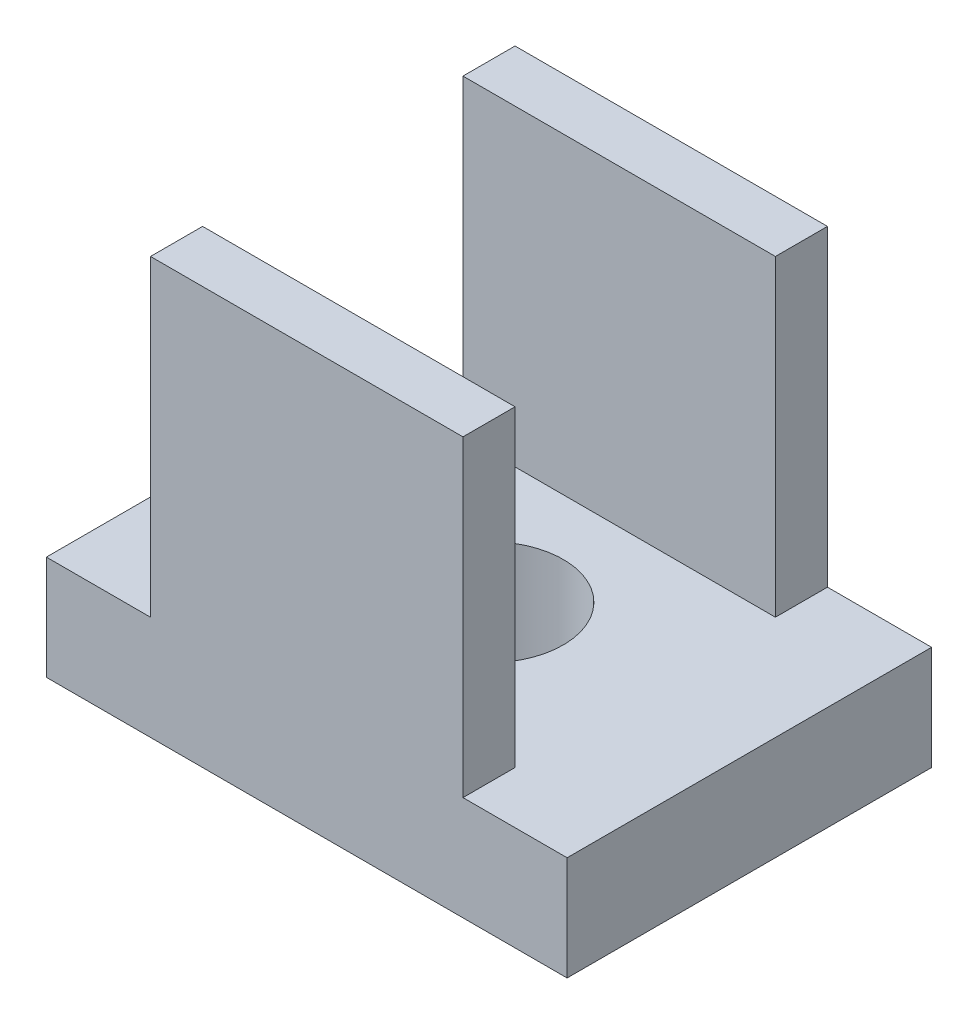
ISO-10303-21;
HEADER;
FILE_DESCRIPTION(('STEP AP214'),'2;1');
FILE_NAME('part.step','',(''),(''),'','','');
FILE_SCHEMA(('AUTOMOTIVE_DESIGN { 1 0 10303 214 1 1 1 1 }'));
ENDSEC;
DATA;
#1=APPLICATION_CONTEXT('core data for automotive mechanical design processes');
#2=APPLICATION_PROTOCOL_DEFINITION('international standard','automotive_design',2000,#1);
#3=PRODUCT_CONTEXT('',#1,'mechanical');
#4=PRODUCT('Part','Part','',(#3));
#5=PRODUCT_RELATED_PRODUCT_CATEGORY('part','',(#4));
#6=PRODUCT_DEFINITION_FORMATION('','',#4);
#7=PRODUCT_DEFINITION_CONTEXT('part definition',#1,'design');
#8=PRODUCT_DEFINITION('design','',#6,#7);
#9=PRODUCT_DEFINITION_SHAPE('','',#8);
#10=(LENGTH_UNIT() NAMED_UNIT(*) SI_UNIT(.MILLI.,.METRE.));
#11=(NAMED_UNIT(*) PLANE_ANGLE_UNIT() SI_UNIT($,.RADIAN.));
#12=(NAMED_UNIT(*) SI_UNIT($,.STERADIAN.) SOLID_ANGLE_UNIT());
#13=UNCERTAINTY_MEASURE_WITH_UNIT(LENGTH_MEASURE(1.E-05),#10,'distance_accuracy_value','');
#14=(GEOMETRIC_REPRESENTATION_CONTEXT(3) GLOBAL_UNCERTAINTY_ASSIGNED_CONTEXT((#13)) GLOBAL_UNIT_ASSIGNED_CONTEXT((#10,
#11,#12)) REPRESENTATION_CONTEXT('',''));
#15=CARTESIAN_POINT('',(0.,0.,0.));
#16=DIRECTION('',(0.,0.,1.));
#17=DIRECTION('',(1.,0.,0.));
#18=AXIS2_PLACEMENT_3D('',#15,#16,#17);
#19=CARTESIAN_POINT('',(-5.,2.,3.5));
#20=DIRECTION('',(1.,0.,0.));
#21=DIRECTION('',(0.,0.,-1.));
#22=AXIS2_PLACEMENT_3D('',#19,#20,#21);
#23=PLANE('',#22);
#24=DIRECTION('',(0.,0.,1.));
#25=VECTOR('',#24,1.);
#26=CARTESIAN_POINT('',(-5.,0.,3.5));
#27=LINE('',#26,#25);
#28=CARTESIAN_POINT('',(-5.,0.,-3.5));
#29=VERTEX_POINT('',#28);
#30=CARTESIAN_POINT('',(-5.,0.,3.5));
#31=VERTEX_POINT('',#30);
#32=EDGE_CURVE('E220',#29,#31,#27,.T.);
#33=ORIENTED_EDGE('',*,*,#32,.T.);
#34=DIRECTION('',(0.,-1.,0.));
#35=VECTOR('',#34,1.);
#36=CARTESIAN_POINT('',(-5.,2.,3.5));
#37=LINE('',#36,#35);
#38=CARTESIAN_POINT('',(-5.,2.,3.5));
#39=VERTEX_POINT('',#38);
#40=EDGE_CURVE('E11',#39,#31,#37,.T.);
#41=ORIENTED_EDGE('',*,*,#40,.F.);
#42=DIRECTION('',(0.,0.,1.));
#43=VECTOR('',#42,1.);
#44=CARTESIAN_POINT('',(-5.,2.,3.5));
#45=LINE('',#44,#43);
#46=CARTESIAN_POINT('',(-5.,2.,-3.5));
#47=VERTEX_POINT('',#46);
#48=EDGE_CURVE('E224',#47,#39,#45,.T.);
#49=ORIENTED_EDGE('',*,*,#48,.F.);
#50=DIRECTION('',(0.,-1.,0.));
#51=VECTOR('',#50,1.);
#52=CARTESIAN_POINT('',(-5.,2.,-3.5));
#53=LINE('',#52,#51);
#54=EDGE_CURVE('E240',#47,#29,#53,.T.);
#55=ORIENTED_EDGE('',*,*,#54,.T.);
#56=EDGE_LOOP('',(#33,#41,#49,#55));
#57=FACE_BOUND('',#56,.T.);
#58=ADVANCED_FACE('F39',(#57),#23,.F.);
#59=CARTESIAN_POINT('',(5.,2.,3.5));
#60=DIRECTION('',(0.,0.,-1.));
#61=DIRECTION('',(-1.,0.,0.));
#62=AXIS2_PLACEMENT_3D('',#59,#60,#61);
#63=PLANE('',#62);
#64=DIRECTION('',(1.,0.,0.));
#65=VECTOR('',#64,1.);
#66=CARTESIAN_POINT('',(5.,0.,3.5));
#67=LINE('',#66,#65);
#68=CARTESIAN_POINT('',(5.,0.,3.5));
#69=VERTEX_POINT('',#68);
#70=EDGE_CURVE('E244',#31,#69,#67,.T.);
#71=ORIENTED_EDGE('',*,*,#70,.T.);
#72=DIRECTION('',(0.,-1.,0.));
#73=VECTOR('',#72,1.);
#74=CARTESIAN_POINT('',(5.,2.,3.5));
#75=LINE('',#74,#73);
#76=CARTESIAN_POINT('',(5.,2.,3.5));
#77=VERTEX_POINT('',#76);
#78=EDGE_CURVE('E47',#77,#69,#75,.T.);
#79=ORIENTED_EDGE('',*,*,#78,.F.);
#80=DIRECTION('',(1.,0.,0.));
#81=VECTOR('',#80,1.);
#82=CARTESIAN_POINT('',(5.,2.,3.5));
#83=LINE('',#82,#81);
#84=CARTESIAN_POINT('',(3.,2.,3.5));
#85=VERTEX_POINT('',#84);
#86=EDGE_CURVE('E228',#85,#77,#83,.T.);
#87=ORIENTED_EDGE('',*,*,#86,.F.);
#88=DIRECTION('',(0.,-1.,0.));
#89=VECTOR('',#88,1.);
#90=CARTESIAN_POINT('',(3.,8.,3.5));
#91=LINE('',#90,#89);
#92=CARTESIAN_POINT('',(3.,8.,3.5));
#93=VERTEX_POINT('',#92);
#94=EDGE_CURVE('E139',#93,#85,#91,.T.);
#95=ORIENTED_EDGE('',*,*,#94,.F.);
#96=DIRECTION('',(-1.,0.,0.));
#97=VECTOR('',#96,1.);
#98=CARTESIAN_POINT('',(3.,8.,3.5));
#99=LINE('',#98,#97);
#100=CARTESIAN_POINT('',(-3.,8.,3.5));
#101=VERTEX_POINT('',#100);
#102=EDGE_CURVE('E145',#93,#101,#99,.T.);
#103=ORIENTED_EDGE('',*,*,#102,.T.);
#104=DIRECTION('',(0.,-1.,0.));
#105=VECTOR('',#104,1.);
#106=CARTESIAN_POINT('',(-3.,8.,3.5));
#107=LINE('',#106,#105);
#108=CARTESIAN_POINT('',(-3.,2.,3.5));
#109=VERTEX_POINT('',#108);
#110=EDGE_CURVE('E128',#101,#109,#107,.T.);
#111=ORIENTED_EDGE('',*,*,#110,.T.);
#112=EDGE_CURVE('E230',#39,#109,#83,.T.);
#113=ORIENTED_EDGE('',*,*,#112,.F.);
#114=ORIENTED_EDGE('',*,*,#40,.T.);
#115=EDGE_LOOP('',(#71,#79,#87,#95,#103,#111,#113,#114));
#116=FACE_BOUND('',#115,.T.);
#117=ADVANCED_FACE('F151',(#116),#63,.F.);
#118=CARTESIAN_POINT('',(5.,2.,3.5));
#119=DIRECTION('',(-1.,0.,0.));
#120=DIRECTION('',(0.,0.,1.));
#121=AXIS2_PLACEMENT_3D('',#118,#119,#120);
#122=PLANE('',#121);
#123=DIRECTION('',(0.,0.,-1.));
#124=VECTOR('',#123,1.);
#125=CARTESIAN_POINT('',(5.,0.,3.5));
#126=LINE('',#125,#124);
#127=CARTESIAN_POINT('',(5.,0.,-3.5));
#128=VERTEX_POINT('',#127);
#129=EDGE_CURVE('E247',#69,#128,#126,.T.);
#130=ORIENTED_EDGE('',*,*,#129,.T.);
#131=DIRECTION('',(0.,-1.,0.));
#132=VECTOR('',#131,1.);
#133=CARTESIAN_POINT('',(5.,2.,-3.5));
#134=LINE('',#133,#132);
#135=CARTESIAN_POINT('',(5.,2.,-3.5));
#136=VERTEX_POINT('',#135);
#137=EDGE_CURVE('E255',#136,#128,#134,.T.);
#138=ORIENTED_EDGE('',*,*,#137,.F.);
#139=DIRECTION('',(0.,0.,-1.));
#140=VECTOR('',#139,1.);
#141=CARTESIAN_POINT('',(5.,2.,3.5));
#142=LINE('',#141,#140);
#143=EDGE_CURVE('E233',#77,#136,#142,.T.);
#144=ORIENTED_EDGE('',*,*,#143,.F.);
#145=ORIENTED_EDGE('',*,*,#78,.T.);
#146=EDGE_LOOP('',(#130,#138,#144,#145));
#147=FACE_BOUND('',#146,.T.);
#148=ADVANCED_FACE('F264',(#147),#122,.F.);
#149=CARTESIAN_POINT('',(5.,2.,-3.5));
#150=DIRECTION('',(0.,0.,1.));
#151=DIRECTION('',(1.,0.,0.));
#152=AXIS2_PLACEMENT_3D('',#149,#150,#151);
#153=PLANE('',#152);
#154=DIRECTION('',(-1.,0.,0.));
#155=VECTOR('',#154,1.);
#156=CARTESIAN_POINT('',(5.,0.,-3.5));
#157=LINE('',#156,#155);
#158=EDGE_CURVE('E229',#128,#29,#157,.T.);
#159=ORIENTED_EDGE('',*,*,#158,.T.);
#160=ORIENTED_EDGE('',*,*,#54,.F.);
#161=DIRECTION('',(-1.,0.,0.));
#162=VECTOR('',#161,1.);
#163=CARTESIAN_POINT('',(5.,2.,-3.5));
#164=LINE('',#163,#162);
#165=CARTESIAN_POINT('',(-3.,2.,-3.5));
#166=VERTEX_POINT('',#165);
#167=EDGE_CURVE('E236',#166,#47,#164,.T.);
#168=ORIENTED_EDGE('',*,*,#167,.F.);
#169=DIRECTION('',(0.,-1.,0.));
#170=VECTOR('',#169,1.);
#171=CARTESIAN_POINT('',(-3.,8.,-3.5));
#172=LINE('',#171,#170);
#173=CARTESIAN_POINT('',(-3.,8.,-3.5));
#174=VERTEX_POINT('',#173);
#175=EDGE_CURVE('E189',#174,#166,#172,.T.);
#176=ORIENTED_EDGE('',*,*,#175,.F.);
#177=DIRECTION('',(-1.,0.,0.));
#178=VECTOR('',#177,1.);
#179=CARTESIAN_POINT('',(3.,8.,-3.5));
#180=LINE('',#179,#178);
#181=CARTESIAN_POINT('',(3.,8.,-3.5));
#182=VERTEX_POINT('',#181);
#183=EDGE_CURVE('E186',#182,#174,#180,.T.);
#184=ORIENTED_EDGE('',*,*,#183,.F.);
#185=DIRECTION('',(0.,-1.,0.));
#186=VECTOR('',#185,1.);
#187=CARTESIAN_POINT('',(3.,8.,-3.5));
#188=LINE('',#187,#186);
#189=CARTESIAN_POINT('',(3.,2.,-3.5));
#190=VERTEX_POINT('',#189);
#191=EDGE_CURVE('E203',#182,#190,#188,.T.);
#192=ORIENTED_EDGE('',*,*,#191,.T.);
#193=EDGE_CURVE('E237',#136,#190,#164,.T.);
#194=ORIENTED_EDGE('',*,*,#193,.F.);
#195=ORIENTED_EDGE('',*,*,#137,.T.);
#196=EDGE_LOOP('',(#159,#160,#168,#176,#184,#192,#194,#195));
#197=FACE_BOUND('',#196,.T.);
#198=ADVANCED_FACE('F272',(#197),#153,.F.);
#199=CARTESIAN_POINT('',(0.,2.,0.));
#200=DIRECTION('',(0.,1.,0.));
#201=DIRECTION('',(0.,0.,1.));
#202=AXIS2_PLACEMENT_3D('',#199,#200,#201);
#203=PLANE('',#202);
#204=DIRECTION('',(0.,0.,-1.));
#205=VECTOR('',#204,1.);
#206=CARTESIAN_POINT('',(-3.,2.,2.5));
#207=LINE('',#206,#205);
#208=CARTESIAN_POINT('',(-3.,2.,2.5));
#209=VERTEX_POINT('',#208);
#210=EDGE_CURVE('E134',#109,#209,#207,.T.);
#211=ORIENTED_EDGE('',*,*,#210,.T.);
#212=DIRECTION('',(1.,0.,0.));
#213=VECTOR('',#212,1.);
#214=CARTESIAN_POINT('',(3.,2.,2.5));
#215=LINE('',#214,#213);
#216=CARTESIAN_POINT('',(3.,2.,2.5));
#217=VERTEX_POINT('',#216);
#218=EDGE_CURVE('E54',#209,#217,#215,.T.);
#219=ORIENTED_EDGE('',*,*,#218,.T.);
#220=DIRECTION('',(0.,0.,1.));
#221=VECTOR('',#220,1.);
#222=CARTESIAN_POINT('',(3.,2.,2.5));
#223=LINE('',#222,#221);
#224=EDGE_CURVE('E59',#217,#85,#223,.T.);
#225=ORIENTED_EDGE('',*,*,#224,.T.);
#226=ORIENTED_EDGE('',*,*,#86,.T.);
#227=ORIENTED_EDGE('',*,*,#143,.T.);
#228=ORIENTED_EDGE('',*,*,#193,.T.);
#229=DIRECTION('',(0.,0.,-1.));
#230=VECTOR('',#229,1.);
#231=CARTESIAN_POINT('',(3.,2.,-2.5));
#232=LINE('',#231,#230);
#233=CARTESIAN_POINT('',(3.,2.,-2.5));
#234=VERTEX_POINT('',#233);
#235=EDGE_CURVE('E180',#234,#190,#232,.T.);
#236=ORIENTED_EDGE('',*,*,#235,.F.);
#237=DIRECTION('',(1.,0.,0.));
#238=VECTOR('',#237,1.);
#239=CARTESIAN_POINT('',(3.,2.,-2.5));
#240=LINE('',#239,#238);
#241=CARTESIAN_POINT('',(-3.,2.,-2.5));
#242=VERTEX_POINT('',#241);
#243=EDGE_CURVE('E193',#242,#234,#240,.T.);
#244=ORIENTED_EDGE('',*,*,#243,.F.);
#245=DIRECTION('',(0.,0.,1.));
#246=VECTOR('',#245,1.);
#247=CARTESIAN_POINT('',(-3.,2.,-2.5));
#248=LINE('',#247,#246);
#249=EDGE_CURVE('E138',#166,#242,#248,.T.);
#250=ORIENTED_EDGE('',*,*,#249,.F.);
#251=ORIENTED_EDGE('',*,*,#167,.T.);
#252=ORIENTED_EDGE('',*,*,#48,.T.);
#253=ORIENTED_EDGE('',*,*,#112,.T.);
#254=EDGE_LOOP('',(#211,#219,#225,#226,#227,#228,#236,#244,#250,#251,#252,#253));
#255=FACE_BOUND('',#254,.T.);
#256=CARTESIAN_POINT('',(0.,2.,0.));
#257=DIRECTION('',(0.,1.,0.));
#258=DIRECTION('',(0.,0.,1.));
#259=AXIS2_PLACEMENT_3D('',#256,#257,#258);
#260=CIRCLE('',#259,1.425);
#261=CARTESIAN_POINT('',(0.,2.,1.425));
#262=VERTEX_POINT('',#261);
#263=EDGE_CURVE('E215',#262,#262,#260,.T.);
#264=ORIENTED_EDGE('',*,*,#263,.F.);
#265=EDGE_LOOP('',(#264));
#266=FACE_BOUND('',#265,.T.);
#267=ADVANCED_FACE('F278',(#255,#266),#203,.T.);
#268=CARTESIAN_POINT('',(0.,0.,0.));
#269=DIRECTION('',(0.,1.,0.));
#270=DIRECTION('',(0.,0.,1.));
#271=AXIS2_PLACEMENT_3D('',#268,#269,#270);
#272=PLANE('',#271);
#273=CARTESIAN_POINT('',(0.,0.,0.));
#274=DIRECTION('',(0.,1.,0.));
#275=DIRECTION('',(0.,0.,1.));
#276=AXIS2_PLACEMENT_3D('',#273,#274,#275);
#277=CIRCLE('',#276,1.425);
#278=CARTESIAN_POINT('',(0.,0.,1.425));
#279=VERTEX_POINT('',#278);
#280=EDGE_CURVE('E216',#279,#279,#277,.T.);
#281=ORIENTED_EDGE('',*,*,#280,.T.);
#282=EDGE_LOOP('',(#281));
#283=FACE_BOUND('',#282,.T.);
#284=ORIENTED_EDGE('',*,*,#32,.F.);
#285=ORIENTED_EDGE('',*,*,#158,.F.);
#286=ORIENTED_EDGE('',*,*,#129,.F.);
#287=ORIENTED_EDGE('',*,*,#70,.F.);
#288=EDGE_LOOP('',(#284,#285,#286,#287));
#289=FACE_BOUND('',#288,.T.);
#290=ADVANCED_FACE('F269',(#283,#289),#272,.F.);
#291=CARTESIAN_POINT('',(0.,0.,0.));
#292=DIRECTION('',(0.,1.,0.));
#293=DIRECTION('',(0.,0.,1.));
#294=AXIS2_PLACEMENT_3D('',#291,#292,#293);
#295=CYLINDRICAL_SURFACE('',#294,1.425);
#296=ORIENTED_EDGE('',*,*,#280,.F.);
#297=EDGE_LOOP('',(#296));
#298=FACE_BOUND('',#297,.T.);
#299=ORIENTED_EDGE('',*,*,#263,.T.);
#300=EDGE_LOOP('',(#299));
#301=FACE_BOUND('',#300,.T.);
#302=ADVANCED_FACE('F308',(#298,#301),#295,.F.);
#303=CARTESIAN_POINT('',(-3.,8.,-2.5));
#304=DIRECTION('',(1.,0.,0.));
#305=DIRECTION('',(0.,0.,-1.));
#306=AXIS2_PLACEMENT_3D('',#303,#304,#305);
#307=PLANE('',#306);
#308=ORIENTED_EDGE('',*,*,#249,.T.);
#309=DIRECTION('',(0.,-1.,0.));
#310=VECTOR('',#309,1.);
#311=CARTESIAN_POINT('',(-3.,8.,-2.5));
#312=LINE('',#311,#310);
#313=CARTESIAN_POINT('',(-3.,8.,-2.5));
#314=VERTEX_POINT('',#313);
#315=EDGE_CURVE('E211',#314,#242,#312,.T.);
#316=ORIENTED_EDGE('',*,*,#315,.F.);
#317=DIRECTION('',(0.,0.,1.));
#318=VECTOR('',#317,1.);
#319=CARTESIAN_POINT('',(-3.,8.,-2.5));
#320=LINE('',#319,#318);
#321=EDGE_CURVE('E175',#174,#314,#320,.T.);
#322=ORIENTED_EDGE('',*,*,#321,.F.);
#323=ORIENTED_EDGE('',*,*,#175,.T.);
#324=EDGE_LOOP('',(#308,#316,#322,#323));
#325=FACE_BOUND('',#324,.T.);
#326=ADVANCED_FACE('F314',(#325),#307,.F.);
#327=CARTESIAN_POINT('',(3.,8.,-2.5));
#328=DIRECTION('',(0.,0.,-1.));
#329=DIRECTION('',(-1.,0.,0.));
#330=AXIS2_PLACEMENT_3D('',#327,#328,#329);
#331=PLANE('',#330);
#332=ORIENTED_EDGE('',*,*,#243,.T.);
#333=DIRECTION('',(0.,-1.,0.));
#334=VECTOR('',#333,1.);
#335=CARTESIAN_POINT('',(3.,8.,-2.5));
#336=LINE('',#335,#334);
#337=CARTESIAN_POINT('',(3.,8.,-2.5));
#338=VERTEX_POINT('',#337);
#339=EDGE_CURVE('E207',#338,#234,#336,.T.);
#340=ORIENTED_EDGE('',*,*,#339,.F.);
#341=DIRECTION('',(1.,0.,0.));
#342=VECTOR('',#341,1.);
#343=CARTESIAN_POINT('',(3.,8.,-2.5));
#344=LINE('',#343,#342);
#345=EDGE_CURVE('E179',#314,#338,#344,.T.);
#346=ORIENTED_EDGE('',*,*,#345,.F.);
#347=ORIENTED_EDGE('',*,*,#315,.T.);
#348=EDGE_LOOP('',(#332,#340,#346,#347));
#349=FACE_BOUND('',#348,.T.);
#350=ADVANCED_FACE('F318',(#349),#331,.F.);
#351=CARTESIAN_POINT('',(3.,8.,-2.5));
#352=DIRECTION('',(-1.,0.,0.));
#353=DIRECTION('',(0.,0.,1.));
#354=AXIS2_PLACEMENT_3D('',#351,#352,#353);
#355=PLANE('',#354);
#356=ORIENTED_EDGE('',*,*,#235,.T.);
#357=ORIENTED_EDGE('',*,*,#191,.F.);
#358=DIRECTION('',(0.,0.,-1.));
#359=VECTOR('',#358,1.);
#360=CARTESIAN_POINT('',(3.,8.,-2.5));
#361=LINE('',#360,#359);
#362=EDGE_CURVE('E183',#338,#182,#361,.T.);
#363=ORIENTED_EDGE('',*,*,#362,.F.);
#364=ORIENTED_EDGE('',*,*,#339,.T.);
#365=EDGE_LOOP('',(#356,#357,#363,#364));
#366=FACE_BOUND('',#365,.T.);
#367=ADVANCED_FACE('F322',(#366),#355,.F.);
#368=CARTESIAN_POINT('',(0.,8.,0.));
#369=DIRECTION('',(0.,1.,0.));
#370=DIRECTION('',(0.,0.,1.));
#371=AXIS2_PLACEMENT_3D('',#368,#369,#370);
#372=PLANE('',#371);
#373=ORIENTED_EDGE('',*,*,#321,.T.);
#374=ORIENTED_EDGE('',*,*,#345,.T.);
#375=ORIENTED_EDGE('',*,*,#362,.T.);
#376=ORIENTED_EDGE('',*,*,#183,.T.);
#377=EDGE_LOOP('',(#373,#374,#375,#376));
#378=FACE_BOUND('',#377,.T.);
#379=ADVANCED_FACE('F326',(#378),#372,.T.);
#380=CARTESIAN_POINT('',(-3.,8.,2.5));
#381=DIRECTION('',(-1.,0.,0.));
#382=DIRECTION('',(0.,0.,1.));
#383=AXIS2_PLACEMENT_3D('',#380,#381,#382);
#384=PLANE('',#383);
#385=ORIENTED_EDGE('',*,*,#210,.F.);
#386=ORIENTED_EDGE('',*,*,#110,.F.);
#387=DIRECTION('',(0.,0.,-1.));
#388=VECTOR('',#387,1.);
#389=CARTESIAN_POINT('',(-3.,8.,2.5));
#390=LINE('',#389,#388);
#391=CARTESIAN_POINT('',(-3.,8.,2.5));
#392=VERTEX_POINT('',#391);
#393=EDGE_CURVE('E132',#101,#392,#390,.T.);
#394=ORIENTED_EDGE('',*,*,#393,.T.);
#395=DIRECTION('',(0.,-1.,0.));
#396=VECTOR('',#395,1.);
#397=CARTESIAN_POINT('',(-3.,8.,2.5));
#398=LINE('',#397,#396);
#399=EDGE_CURVE('E161',#392,#209,#398,.T.);
#400=ORIENTED_EDGE('',*,*,#399,.T.);
#401=EDGE_LOOP('',(#385,#386,#394,#400));
#402=FACE_BOUND('',#401,.T.);
#403=ADVANCED_FACE('F130',(#402),#384,.T.);
#404=CARTESIAN_POINT('',(3.,8.,2.5));
#405=DIRECTION('',(1.,0.,0.));
#406=DIRECTION('',(0.,0.,-1.));
#407=AXIS2_PLACEMENT_3D('',#404,#405,#406);
#408=PLANE('',#407);
#409=ORIENTED_EDGE('',*,*,#224,.F.);
#410=DIRECTION('',(0.,-1.,0.));
#411=VECTOR('',#410,1.);
#412=CARTESIAN_POINT('',(3.,8.,2.5));
#413=LINE('',#412,#411);
#414=CARTESIAN_POINT('',(3.,8.,2.5));
#415=VERTEX_POINT('',#414);
#416=EDGE_CURVE('E170',#415,#217,#413,.T.);
#417=ORIENTED_EDGE('',*,*,#416,.F.);
#418=DIRECTION('',(0.,0.,1.));
#419=VECTOR('',#418,1.);
#420=CARTESIAN_POINT('',(3.,8.,2.5));
#421=LINE('',#420,#419);
#422=EDGE_CURVE('E154',#415,#93,#421,.T.);
#423=ORIENTED_EDGE('',*,*,#422,.T.);
#424=ORIENTED_EDGE('',*,*,#94,.T.);
#425=EDGE_LOOP('',(#409,#417,#423,#424));
#426=FACE_BOUND('',#425,.T.);
#427=ADVANCED_FACE('F284',(#426),#408,.T.);
#428=CARTESIAN_POINT('',(3.,8.,2.5));
#429=DIRECTION('',(0.,0.,-1.));
#430=DIRECTION('',(-1.,0.,0.));
#431=AXIS2_PLACEMENT_3D('',#428,#429,#430);
#432=PLANE('',#431);
#433=ORIENTED_EDGE('',*,*,#218,.F.);
#434=ORIENTED_EDGE('',*,*,#399,.F.);
#435=DIRECTION('',(1.,0.,0.));
#436=VECTOR('',#435,1.);
#437=CARTESIAN_POINT('',(3.,8.,2.5));
#438=LINE('',#437,#436);
#439=EDGE_CURVE('E148',#392,#415,#438,.T.);
#440=ORIENTED_EDGE('',*,*,#439,.T.);
#441=ORIENTED_EDGE('',*,*,#416,.T.);
#442=EDGE_LOOP('',(#433,#434,#440,#441));
#443=FACE_BOUND('',#442,.T.);
#444=ADVANCED_FACE('F286',(#443),#432,.T.);
#445=CARTESIAN_POINT('',(0.,8.,0.));
#446=DIRECTION('',(0.,1.,0.));
#447=DIRECTION('',(0.,0.,-1.));
#448=AXIS2_PLACEMENT_3D('',#445,#446,#447);
#449=PLANE('',#448);
#450=ORIENTED_EDGE('',*,*,#393,.F.);
#451=ORIENTED_EDGE('',*,*,#102,.F.);
#452=ORIENTED_EDGE('',*,*,#422,.F.);
#453=ORIENTED_EDGE('',*,*,#439,.F.);
#454=EDGE_LOOP('',(#450,#451,#452,#453));
#455=FACE_BOUND('',#454,.T.);
#456=ADVANCED_FACE('F143',(#455),#449,.T.);
#457=CLOSED_SHELL('',(#58,#117,#148,#198,#267,#290,#302,#326,#350,#367,#379,#403,#427,#444,#456));
#458=MANIFOLD_SOLID_BREP('B2',#457);
#459=ADVANCED_BREP_SHAPE_REPRESENTATION('',(#18,#458),#14);
#460=SHAPE_DEFINITION_REPRESENTATION(#9,#459);
ENDSEC;
END-ISO-10303-21;
